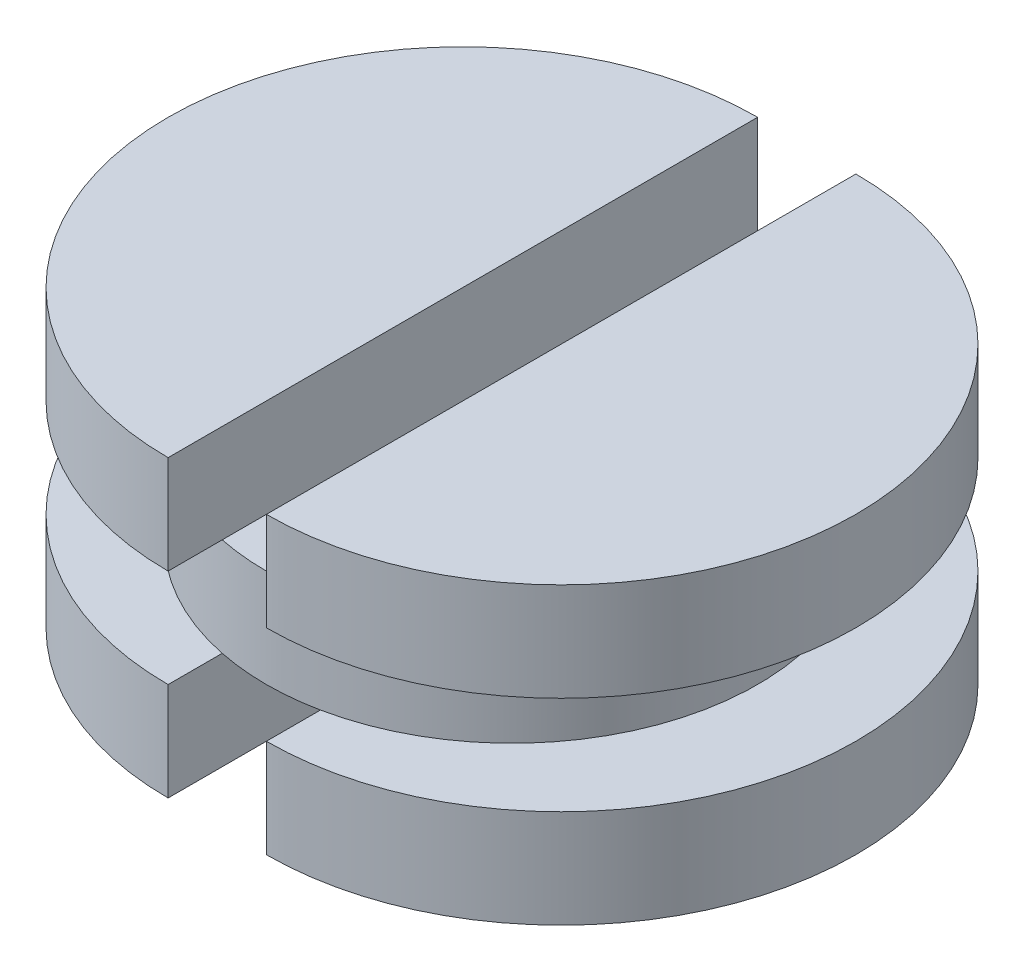
ISO-10303-21;
HEADER;
FILE_DESCRIPTION(('STEP AP214'),'2;1');
FILE_NAME('part.step','',(''),(''),'','','');
FILE_SCHEMA(('AUTOMOTIVE_DESIGN { 1 0 10303 214 1 1 1 1 }'));
ENDSEC;
DATA;
#1=APPLICATION_CONTEXT('core data for automotive mechanical design processes');
#2=APPLICATION_PROTOCOL_DEFINITION('international standard','automotive_design',2000,#1);
#3=PRODUCT_CONTEXT('',#1,'mechanical');
#4=PRODUCT('Part','Part','',(#3));
#5=PRODUCT_RELATED_PRODUCT_CATEGORY('part','',(#4));
#6=PRODUCT_DEFINITION_FORMATION('','',#4);
#7=PRODUCT_DEFINITION_CONTEXT('part definition',#1,'design');
#8=PRODUCT_DEFINITION('design','',#6,#7);
#9=PRODUCT_DEFINITION_SHAPE('','',#8);
#10=(LENGTH_UNIT() NAMED_UNIT(*) SI_UNIT(.MILLI.,.METRE.));
#11=(NAMED_UNIT(*) PLANE_ANGLE_UNIT() SI_UNIT($,.RADIAN.));
#12=(NAMED_UNIT(*) SI_UNIT($,.STERADIAN.) SOLID_ANGLE_UNIT());
#13=UNCERTAINTY_MEASURE_WITH_UNIT(LENGTH_MEASURE(1.E-05),#10,'distance_accuracy_value','');
#14=(GEOMETRIC_REPRESENTATION_CONTEXT(3) GLOBAL_UNCERTAINTY_ASSIGNED_CONTEXT((#13)) GLOBAL_UNIT_ASSIGNED_CONTEXT((#10,
#11,#12)) REPRESENTATION_CONTEXT('',''));
#15=CARTESIAN_POINT('',(0.,0.,0.));
#16=DIRECTION('',(0.,0.,1.));
#17=DIRECTION('',(1.,0.,0.));
#18=AXIS2_PLACEMENT_3D('',#15,#16,#17);
#19=CARTESIAN_POINT('',(0.,0.4,0.));
#20=DIRECTION('',(0.,1.,0.));
#21=DIRECTION('',(0.,0.,1.));
#22=AXIS2_PLACEMENT_3D('',#19,#20,#21);
#23=PLANE('',#22);
#24=CARTESIAN_POINT('',(0.,0.4,0.));
#25=DIRECTION('',(0.,1.,0.));
#26=DIRECTION('',(0.,0.,1.));
#27=AXIS2_PLACEMENT_3D('',#24,#25,#26);
#28=CIRCLE('',#27,0.5);
#29=CARTESIAN_POINT('',(-0.1,0.4,0.489897948556636));
#30=VERTEX_POINT('',#29);
#31=CARTESIAN_POINT('',(0.1,0.4,0.489897948556635));
#32=VERTEX_POINT('',#31);
#33=EDGE_CURVE('E218',#30,#32,#28,.T.);
#34=ORIENTED_EDGE('',*,*,#33,.T.);
#35=DIRECTION('',(0.,0.,-1.));
#36=VECTOR('',#35,1.);
#37=CARTESIAN_POINT('',(0.1,0.4,0.));
#38=LINE('',#37,#36);
#39=CARTESIAN_POINT('',(0.1,0.4,-0.489897948556636));
#40=VERTEX_POINT('',#39);
#41=EDGE_CURVE('E11',#32,#40,#38,.T.);
#42=ORIENTED_EDGE('',*,*,#41,.T.);
#43=CARTESIAN_POINT('',(-0.1,0.4,-0.489897948556635));
#44=VERTEX_POINT('',#43);
#45=EDGE_CURVE('E219',#40,#44,#28,.T.);
#46=ORIENTED_EDGE('',*,*,#45,.T.);
#47=DIRECTION('',(0.,0.,-1.));
#48=VECTOR('',#47,1.);
#49=CARTESIAN_POINT('',(-0.1,0.4,0.6));
#50=LINE('',#49,#48);
#51=EDGE_CURVE('E54',#30,#44,#50,.T.);
#52=ORIENTED_EDGE('',*,*,#51,.F.);
#53=EDGE_LOOP('',(#34,#42,#46,#52));
#54=FACE_BOUND('',#53,.T.);
#55=ADVANCED_FACE('F45',(#54),#23,.T.);
#56=CARTESIAN_POINT('',(0.,0.2,0.));
#57=DIRECTION('',(0.,1.,0.));
#58=DIRECTION('',(0.,0.,1.));
#59=AXIS2_PLACEMENT_3D('',#56,#57,#58);
#60=PLANE('',#59);
#61=DIRECTION('',(0.,0.,-1.));
#62=VECTOR('',#61,1.);
#63=CARTESIAN_POINT('',(-0.1,0.2,0.6));
#64=LINE('',#63,#62);
#65=CARTESIAN_POINT('',(-0.1,0.2,0.489897948556636));
#66=VERTEX_POINT('',#65);
#67=CARTESIAN_POINT('',(-0.1,0.2,-0.489897948556636));
#68=VERTEX_POINT('',#67);
#69=EDGE_CURVE('E209',#66,#68,#64,.T.);
#70=ORIENTED_EDGE('',*,*,#69,.T.);
#71=CARTESIAN_POINT('',(0.,0.2,0.));
#72=DIRECTION('',(0.,1.,0.));
#73=DIRECTION('',(0.,0.,1.));
#74=AXIS2_PLACEMENT_3D('',#71,#72,#73);
#75=CIRCLE('',#74,0.5);
#76=CARTESIAN_POINT('',(0.1,0.2,-0.489897948556636));
#77=VERTEX_POINT('',#76);
#78=EDGE_CURVE('E224',#77,#68,#75,.T.);
#79=ORIENTED_EDGE('',*,*,#78,.F.);
#80=DIRECTION('',(0.,0.,1.));
#81=VECTOR('',#80,1.);
#82=CARTESIAN_POINT('',(0.1,0.2,0.6));
#83=LINE('',#82,#81);
#84=CARTESIAN_POINT('',(0.1,0.2,0.489897948556636));
#85=VERTEX_POINT('',#84);
#86=EDGE_CURVE('E235',#77,#85,#83,.T.);
#87=ORIENTED_EDGE('',*,*,#86,.T.);
#88=EDGE_CURVE('E205',#66,#85,#75,.T.);
#89=ORIENTED_EDGE('',*,*,#88,.F.);
#90=EDGE_LOOP('',(#70,#79,#87,#89));
#91=FACE_BOUND('',#90,.T.);
#92=ADVANCED_FACE('F275',(#91),#60,.F.);
#93=CARTESIAN_POINT('',(0.1,0.2,0.));
#94=DIRECTION('',(0.,-1.,0.));
#95=DIRECTION('',(0.,0.,-1.));
#96=AXIS2_PLACEMENT_3D('',#93,#94,#95);
#97=CYLINDRICAL_SURFACE('',#96,0.6);
#98=CARTESIAN_POINT('',(0.1,0.,0.));
#99=DIRECTION('',(0.,1.,0.));
#100=DIRECTION('',(0.,0.,1.));
#101=AXIS2_PLACEMENT_3D('',#98,#99,#100);
#102=CIRCLE('',#101,0.6);
#103=CARTESIAN_POINT('',(0.1,0.,0.6));
#104=VERTEX_POINT('',#103);
#105=CARTESIAN_POINT('',(0.1,0.,-0.6));
#106=VERTEX_POINT('',#105);
#107=EDGE_CURVE('E217',#104,#106,#102,.T.);
#108=ORIENTED_EDGE('',*,*,#107,.T.);
#109=DIRECTION('',(0.,-1.,0.));
#110=VECTOR('',#109,1.);
#111=CARTESIAN_POINT('',(0.1,0.2,-0.6));
#112=LINE('',#111,#110);
#113=CARTESIAN_POINT('',(0.1,0.2,-0.6));
#114=VERTEX_POINT('',#113);
#115=EDGE_CURVE('E243',#114,#106,#112,.T.);
#116=ORIENTED_EDGE('',*,*,#115,.F.);
#117=CARTESIAN_POINT('',(0.1,0.2,0.));
#118=DIRECTION('',(0.,1.,0.));
#119=DIRECTION('',(0.,0.,1.));
#120=AXIS2_PLACEMENT_3D('',#117,#118,#119);
#121=CIRCLE('',#120,0.6);
#122=CARTESIAN_POINT('',(0.1,0.2,0.6));
#123=VERTEX_POINT('',#122);
#124=EDGE_CURVE('E225',#123,#114,#121,.T.);
#125=ORIENTED_EDGE('',*,*,#124,.F.);
#126=DIRECTION('',(0.,-1.,0.));
#127=VECTOR('',#126,1.);
#128=CARTESIAN_POINT('',(0.1,0.2,0.6));
#129=LINE('',#128,#127);
#130=EDGE_CURVE('E234',#123,#104,#129,.T.);
#131=ORIENTED_EDGE('',*,*,#130,.T.);
#132=EDGE_LOOP('',(#108,#116,#125,#131));
#133=FACE_BOUND('',#132,.T.);
#134=ADVANCED_FACE('F47',(#133),#97,.T.);
#135=CARTESIAN_POINT('',(0.1,0.2,0.6));
#136=DIRECTION('',(1.,0.,0.));
#137=DIRECTION('',(0.,0.,-1.));
#138=AXIS2_PLACEMENT_3D('',#135,#136,#137);
#139=PLANE('',#138);
#140=DIRECTION('',(0.,0.,1.));
#141=VECTOR('',#140,1.);
#142=CARTESIAN_POINT('',(0.1,0.,0.6));
#143=LINE('',#142,#141);
#144=EDGE_CURVE('E230',#106,#104,#143,.T.);
#145=ORIENTED_EDGE('',*,*,#144,.T.);
#146=ORIENTED_EDGE('',*,*,#130,.F.);
#147=EDGE_CURVE('E229',#85,#123,#83,.T.);
#148=ORIENTED_EDGE('',*,*,#147,.F.);
#149=ORIENTED_EDGE('',*,*,#86,.F.);
#150=EDGE_CURVE('E231',#114,#77,#83,.T.);
#151=ORIENTED_EDGE('',*,*,#150,.F.);
#152=ORIENTED_EDGE('',*,*,#115,.T.);
#153=EDGE_LOOP('',(#145,#146,#148,#149,#151,#152));
#154=FACE_BOUND('',#153,.T.);
#155=ADVANCED_FACE('F296',(#154),#139,.F.);
#156=CARTESIAN_POINT('',(0.1,0.2,0.));
#157=DIRECTION('',(0.,1.,0.));
#158=DIRECTION('',(0.,0.,1.));
#159=AXIS2_PLACEMENT_3D('',#156,#157,#158);
#160=PLANE('',#159);
#161=EDGE_CURVE('E220',#85,#77,#75,.T.);
#162=ORIENTED_EDGE('',*,*,#161,.F.);
#163=ORIENTED_EDGE('',*,*,#147,.T.);
#164=ORIENTED_EDGE('',*,*,#124,.T.);
#165=ORIENTED_EDGE('',*,*,#150,.T.);
#166=EDGE_LOOP('',(#162,#163,#164,#165));
#167=FACE_BOUND('',#166,.T.);
#168=ADVANCED_FACE('F293',(#167),#160,.T.);
#169=CARTESIAN_POINT('',(0.1,0.,0.));
#170=DIRECTION('',(0.,1.,0.));
#171=DIRECTION('',(0.,0.,1.));
#172=AXIS2_PLACEMENT_3D('',#169,#170,#171);
#173=PLANE('',#172);
#174=ORIENTED_EDGE('',*,*,#107,.F.);
#175=ORIENTED_EDGE('',*,*,#144,.F.);
#176=EDGE_LOOP('',(#174,#175));
#177=FACE_BOUND('',#176,.T.);
#178=ADVANCED_FACE('F291',(#177),#173,.F.);
#179=CARTESIAN_POINT('',(0.,0.4,0.));
#180=DIRECTION('',(0.,-1.,0.));
#181=DIRECTION('',(0.,0.,-1.));
#182=AXIS2_PLACEMENT_3D('',#179,#180,#181);
#183=CYLINDRICAL_SURFACE('',#182,0.5);
#184=EDGE_CURVE('E213',#44,#30,#28,.T.);
#185=ORIENTED_EDGE('',*,*,#184,.F.);
#186=ORIENTED_EDGE('',*,*,#45,.F.);
#187=EDGE_CURVE('E327',#32,#40,#28,.T.);
#188=ORIENTED_EDGE('',*,*,#187,.F.);
#189=ORIENTED_EDGE('',*,*,#33,.F.);
#190=EDGE_LOOP('',(#185,#186,#188,#189));
#191=FACE_BOUND('',#190,.T.);
#192=ORIENTED_EDGE('',*,*,#161,.T.);
#193=ORIENTED_EDGE('',*,*,#78,.T.);
#194=EDGE_CURVE('E322',#68,#66,#75,.T.);
#195=ORIENTED_EDGE('',*,*,#194,.T.);
#196=ORIENTED_EDGE('',*,*,#88,.T.);
#197=EDGE_LOOP('',(#192,#193,#195,#196));
#198=FACE_BOUND('',#197,.T.);
#199=ADVANCED_FACE('F288',(#191,#198),#183,.T.);
#200=CARTESIAN_POINT('',(-0.1,0.2,0.));
#201=DIRECTION('',(0.,-1.,0.));
#202=DIRECTION('',(0.,0.,-1.));
#203=AXIS2_PLACEMENT_3D('',#200,#201,#202);
#204=CYLINDRICAL_SURFACE('',#203,0.6);
#205=CARTESIAN_POINT('',(-0.1,0.,0.));
#206=DIRECTION('',(0.,1.,0.));
#207=DIRECTION('',(0.,0.,1.));
#208=AXIS2_PLACEMENT_3D('',#205,#206,#207);
#209=CIRCLE('',#208,0.6);
#210=CARTESIAN_POINT('',(-0.1,0.,-0.6));
#211=VERTEX_POINT('',#210);
#212=CARTESIAN_POINT('',(-0.1,0.,0.6));
#213=VERTEX_POINT('',#212);
#214=EDGE_CURVE('E200',#211,#213,#209,.T.);
#215=ORIENTED_EDGE('',*,*,#214,.T.);
#216=DIRECTION('',(0.,-1.,0.));
#217=VECTOR('',#216,1.);
#218=CARTESIAN_POINT('',(-0.1,0.2,0.6));
#219=LINE('',#218,#217);
#220=CARTESIAN_POINT('',(-0.1,0.2,0.6));
#221=VERTEX_POINT('',#220);
#222=EDGE_CURVE('E188',#221,#213,#219,.T.);
#223=ORIENTED_EDGE('',*,*,#222,.F.);
#224=CARTESIAN_POINT('',(-0.1,0.2,0.));
#225=DIRECTION('',(0.,1.,0.));
#226=DIRECTION('',(0.,0.,1.));
#227=AXIS2_PLACEMENT_3D('',#224,#225,#226);
#228=CIRCLE('',#227,0.6);
#229=CARTESIAN_POINT('',(-0.1,0.2,-0.6));
#230=VERTEX_POINT('',#229);
#231=EDGE_CURVE('E201',#230,#221,#228,.T.);
#232=ORIENTED_EDGE('',*,*,#231,.F.);
#233=DIRECTION('',(0.,-1.,0.));
#234=VECTOR('',#233,1.);
#235=CARTESIAN_POINT('',(-0.1,0.2,-0.6));
#236=LINE('',#235,#234);
#237=EDGE_CURVE('E192',#230,#211,#236,.T.);
#238=ORIENTED_EDGE('',*,*,#237,.T.);
#239=EDGE_LOOP('',(#215,#223,#232,#238));
#240=FACE_BOUND('',#239,.T.);
#241=ADVANCED_FACE('F290',(#240),#204,.T.);
#242=CARTESIAN_POINT('',(-0.1,0.2,0.6));
#243=DIRECTION('',(-1.,0.,0.));
#244=DIRECTION('',(0.,0.,1.));
#245=AXIS2_PLACEMENT_3D('',#242,#243,#244);
#246=PLANE('',#245);
#247=DIRECTION('',(0.,0.,-1.));
#248=VECTOR('',#247,1.);
#249=CARTESIAN_POINT('',(-0.1,0.,0.6));
#250=LINE('',#249,#248);
#251=EDGE_CURVE('E197',#213,#211,#250,.T.);
#252=ORIENTED_EDGE('',*,*,#251,.T.);
#253=ORIENTED_EDGE('',*,*,#237,.F.);
#254=EDGE_CURVE('E196',#68,#230,#64,.T.);
#255=ORIENTED_EDGE('',*,*,#254,.F.);
#256=ORIENTED_EDGE('',*,*,#69,.F.);
#257=EDGE_CURVE('E206',#221,#66,#64,.T.);
#258=ORIENTED_EDGE('',*,*,#257,.F.);
#259=ORIENTED_EDGE('',*,*,#222,.T.);
#260=EDGE_LOOP('',(#252,#253,#255,#256,#258,#259));
#261=FACE_BOUND('',#260,.T.);
#262=ADVANCED_FACE('F338',(#261),#246,.F.);
#263=CARTESIAN_POINT('',(-0.1,0.2,0.));
#264=DIRECTION('',(0.,1.,0.));
#265=DIRECTION('',(0.,0.,1.));
#266=AXIS2_PLACEMENT_3D('',#263,#264,#265);
#267=PLANE('',#266);
#268=ORIENTED_EDGE('',*,*,#194,.F.);
#269=ORIENTED_EDGE('',*,*,#254,.T.);
#270=ORIENTED_EDGE('',*,*,#231,.T.);
#271=ORIENTED_EDGE('',*,*,#257,.T.);
#272=EDGE_LOOP('',(#268,#269,#270,#271));
#273=FACE_BOUND('',#272,.T.);
#274=ADVANCED_FACE('F285',(#273),#267,.T.);
#275=CARTESIAN_POINT('',(-0.1,0.,0.));
#276=DIRECTION('',(0.,1.,0.));
#277=DIRECTION('',(0.,0.,1.));
#278=AXIS2_PLACEMENT_3D('',#275,#276,#277);
#279=PLANE('',#278);
#280=ORIENTED_EDGE('',*,*,#214,.F.);
#281=ORIENTED_EDGE('',*,*,#251,.F.);
#282=EDGE_LOOP('',(#280,#281));
#283=FACE_BOUND('',#282,.T.);
#284=ADVANCED_FACE('F342',(#283),#279,.F.);
#285=CARTESIAN_POINT('',(-0.1,0.4,0.));
#286=DIRECTION('',(0.,1.,0.));
#287=DIRECTION('',(0.,0.,1.));
#288=AXIS2_PLACEMENT_3D('',#285,#286,#287);
#289=PLANE('',#288);
#290=CARTESIAN_POINT('',(-0.1,0.4,-0.6));
#291=VERTEX_POINT('',#290);
#292=EDGE_CURVE('E162',#44,#291,#50,.T.);
#293=ORIENTED_EDGE('',*,*,#292,.F.);
#294=ORIENTED_EDGE('',*,*,#184,.T.);
#295=CARTESIAN_POINT('',(-0.1,0.4,0.6));
#296=VERTEX_POINT('',#295);
#297=EDGE_CURVE('E174',#296,#30,#50,.T.);
#298=ORIENTED_EDGE('',*,*,#297,.F.);
#299=CARTESIAN_POINT('',(-0.1,0.4,0.));
#300=DIRECTION('',(0.,1.,0.));
#301=DIRECTION('',(0.,0.,1.));
#302=AXIS2_PLACEMENT_3D('',#299,#300,#301);
#303=CIRCLE('',#302,0.6);
#304=EDGE_CURVE('E157',#291,#296,#303,.T.);
#305=ORIENTED_EDGE('',*,*,#304,.F.);
#306=EDGE_LOOP('',(#293,#294,#298,#305));
#307=FACE_BOUND('',#306,.T.);
#308=ADVANCED_FACE('F260',(#307),#289,.F.);
#309=CARTESIAN_POINT('',(-0.1,0.6,0.));
#310=DIRECTION('',(0.,-1.,0.));
#311=DIRECTION('',(0.,0.,-1.));
#312=AXIS2_PLACEMENT_3D('',#309,#310,#311);
#313=CYLINDRICAL_SURFACE('',#312,0.6);
#314=ORIENTED_EDGE('',*,*,#304,.T.);
#315=DIRECTION('',(0.,-1.,0.));
#316=VECTOR('',#315,1.);
#317=CARTESIAN_POINT('',(-0.1,0.6,0.6));
#318=LINE('',#317,#316);
#319=CARTESIAN_POINT('',(-0.1,0.6,0.6));
#320=VERTEX_POINT('',#319);
#321=EDGE_CURVE('E184',#320,#296,#318,.T.);
#322=ORIENTED_EDGE('',*,*,#321,.F.);
#323=CARTESIAN_POINT('',(-0.1,0.6,0.));
#324=DIRECTION('',(0.,1.,0.));
#325=DIRECTION('',(0.,0.,1.));
#326=AXIS2_PLACEMENT_3D('',#323,#324,#325);
#327=CIRCLE('',#326,0.6);
#328=CARTESIAN_POINT('',(-0.1,0.6,-0.6));
#329=VERTEX_POINT('',#328);
#330=EDGE_CURVE('E169',#329,#320,#327,.T.);
#331=ORIENTED_EDGE('',*,*,#330,.F.);
#332=DIRECTION('',(0.,-1.,0.));
#333=VECTOR('',#332,1.);
#334=CARTESIAN_POINT('',(-0.1,0.6,-0.6));
#335=LINE('',#334,#333);
#336=EDGE_CURVE('E176',#329,#291,#335,.T.);
#337=ORIENTED_EDGE('',*,*,#336,.T.);
#338=EDGE_LOOP('',(#314,#322,#331,#337));
#339=FACE_BOUND('',#338,.T.);
#340=ADVANCED_FACE('F258',(#339),#313,.T.);
#341=CARTESIAN_POINT('',(-0.1,0.6,0.6));
#342=DIRECTION('',(-1.,0.,0.));
#343=DIRECTION('',(0.,0.,1.));
#344=AXIS2_PLACEMENT_3D('',#341,#342,#343);
#345=PLANE('',#344);
#346=ORIENTED_EDGE('',*,*,#297,.T.);
#347=ORIENTED_EDGE('',*,*,#51,.T.);
#348=ORIENTED_EDGE('',*,*,#292,.T.);
#349=ORIENTED_EDGE('',*,*,#336,.F.);
#350=DIRECTION('',(0.,0.,-1.));
#351=VECTOR('',#350,1.);
#352=CARTESIAN_POINT('',(-0.1,0.6,0.6));
#353=LINE('',#352,#351);
#354=EDGE_CURVE('E173',#320,#329,#353,.T.);
#355=ORIENTED_EDGE('',*,*,#354,.F.);
#356=ORIENTED_EDGE('',*,*,#321,.T.);
#357=EDGE_LOOP('',(#346,#347,#348,#349,#355,#356));
#358=FACE_BOUND('',#357,.T.);
#359=ADVANCED_FACE('F253',(#358),#345,.F.);
#360=CARTESIAN_POINT('',(-0.1,0.6,0.));
#361=DIRECTION('',(0.,1.,0.));
#362=DIRECTION('',(0.,0.,1.));
#363=AXIS2_PLACEMENT_3D('',#360,#361,#362);
#364=PLANE('',#363);
#365=ORIENTED_EDGE('',*,*,#330,.T.);
#366=ORIENTED_EDGE('',*,*,#354,.T.);
#367=EDGE_LOOP('',(#365,#366));
#368=FACE_BOUND('',#367,.T.);
#369=ADVANCED_FACE('F263',(#368),#364,.T.);
#370=CARTESIAN_POINT('',(0.1,0.6,0.));
#371=DIRECTION('',(0.,-1.,0.));
#372=DIRECTION('',(0.,0.,-1.));
#373=AXIS2_PLACEMENT_3D('',#370,#371,#372);
#374=CYLINDRICAL_SURFACE('',#373,0.6);
#375=CARTESIAN_POINT('',(0.1,0.4,0.));
#376=DIRECTION('',(0.,1.,0.));
#377=DIRECTION('',(0.,0.,1.));
#378=AXIS2_PLACEMENT_3D('',#375,#376,#377);
#379=CIRCLE('',#378,0.6);
#380=CARTESIAN_POINT('',(0.1,0.4,0.6));
#381=VERTEX_POINT('',#380);
#382=CARTESIAN_POINT('',(0.1,0.4,-0.6));
#383=VERTEX_POINT('',#382);
#384=EDGE_CURVE('E149',#381,#383,#379,.T.);
#385=ORIENTED_EDGE('',*,*,#384,.T.);
#386=DIRECTION('',(0.,-1.,0.));
#387=VECTOR('',#386,1.);
#388=CARTESIAN_POINT('',(0.1,0.6,-0.6));
#389=LINE('',#388,#387);
#390=CARTESIAN_POINT('',(0.1,0.6,-0.6));
#391=VERTEX_POINT('',#390);
#392=EDGE_CURVE('E153',#391,#383,#389,.T.);
#393=ORIENTED_EDGE('',*,*,#392,.F.);
#394=CARTESIAN_POINT('',(0.1,0.6,0.));
#395=DIRECTION('',(0.,1.,0.));
#396=DIRECTION('',(0.,0.,1.));
#397=AXIS2_PLACEMENT_3D('',#394,#395,#396);
#398=CIRCLE('',#397,0.6);
#399=CARTESIAN_POINT('',(0.1,0.6,0.6));
#400=VERTEX_POINT('',#399);
#401=EDGE_CURVE('E143',#400,#391,#398,.T.);
#402=ORIENTED_EDGE('',*,*,#401,.F.);
#403=DIRECTION('',(0.,-1.,0.));
#404=VECTOR('',#403,1.);
#405=CARTESIAN_POINT('',(0.1,0.6,0.6));
#406=LINE('',#405,#404);
#407=EDGE_CURVE('E137',#400,#381,#406,.T.);
#408=ORIENTED_EDGE('',*,*,#407,.T.);
#409=EDGE_LOOP('',(#385,#393,#402,#408));
#410=FACE_BOUND('',#409,.T.);
#411=ADVANCED_FACE('F147',(#410),#374,.T.);
#412=CARTESIAN_POINT('',(0.1,0.6,-0.6));
#413=DIRECTION('',(1.,0.,0.));
#414=DIRECTION('',(0.,0.,-1.));
#415=AXIS2_PLACEMENT_3D('',#412,#413,#414);
#416=PLANE('',#415);
#417=DIRECTION('',(0.,0.,1.));
#418=VECTOR('',#417,1.);
#419=CARTESIAN_POINT('',(0.1,0.4,-0.6));
#420=LINE('',#419,#418);
#421=EDGE_CURVE('E61',#383,#40,#420,.T.);
#422=ORIENTED_EDGE('',*,*,#421,.T.);
#423=ORIENTED_EDGE('',*,*,#41,.F.);
#424=EDGE_CURVE('E134',#32,#381,#420,.T.);
#425=ORIENTED_EDGE('',*,*,#424,.T.);
#426=ORIENTED_EDGE('',*,*,#407,.F.);
#427=DIRECTION('',(0.,0.,1.));
#428=VECTOR('',#427,1.);
#429=CARTESIAN_POINT('',(0.1,0.6,-0.6));
#430=LINE('',#429,#428);
#431=EDGE_CURVE('E152',#391,#400,#430,.T.);
#432=ORIENTED_EDGE('',*,*,#431,.F.);
#433=ORIENTED_EDGE('',*,*,#392,.T.);
#434=EDGE_LOOP('',(#422,#423,#425,#426,#432,#433));
#435=FACE_BOUND('',#434,.T.);
#436=ADVANCED_FACE('F136',(#435),#416,.F.);
#437=CARTESIAN_POINT('',(0.1,0.6,0.));
#438=DIRECTION('',(0.,1.,0.));
#439=DIRECTION('',(0.,0.,1.));
#440=AXIS2_PLACEMENT_3D('',#437,#438,#439);
#441=PLANE('',#440);
#442=ORIENTED_EDGE('',*,*,#401,.T.);
#443=ORIENTED_EDGE('',*,*,#431,.T.);
#444=EDGE_LOOP('',(#442,#443));
#445=FACE_BOUND('',#444,.T.);
#446=ADVANCED_FACE('F382',(#445),#441,.T.);
#447=CARTESIAN_POINT('',(0.1,0.4,0.));
#448=DIRECTION('',(0.,1.,0.));
#449=DIRECTION('',(0.,0.,1.));
#450=AXIS2_PLACEMENT_3D('',#447,#448,#449);
#451=PLANE('',#450);
#452=ORIENTED_EDGE('',*,*,#424,.F.);
#453=ORIENTED_EDGE('',*,*,#187,.T.);
#454=ORIENTED_EDGE('',*,*,#421,.F.);
#455=ORIENTED_EDGE('',*,*,#384,.F.);
#456=EDGE_LOOP('',(#452,#453,#454,#455));
#457=FACE_BOUND('',#456,.T.);
#458=ADVANCED_FACE('F155',(#457),#451,.F.);
#459=CLOSED_SHELL('',(#55,#92,#134,#155,#168,#178,#199,#241,#262,#274,#284,#308,#340,#359,#369,
#411,#436,#446,#458));
#460=MANIFOLD_SOLID_BREP('B2',#459);
#461=ADVANCED_BREP_SHAPE_REPRESENTATION('',(#18,#460),#14);
#462=SHAPE_DEFINITION_REPRESENTATION(#9,#461);
ENDSEC;
END-ISO-10303-21;
